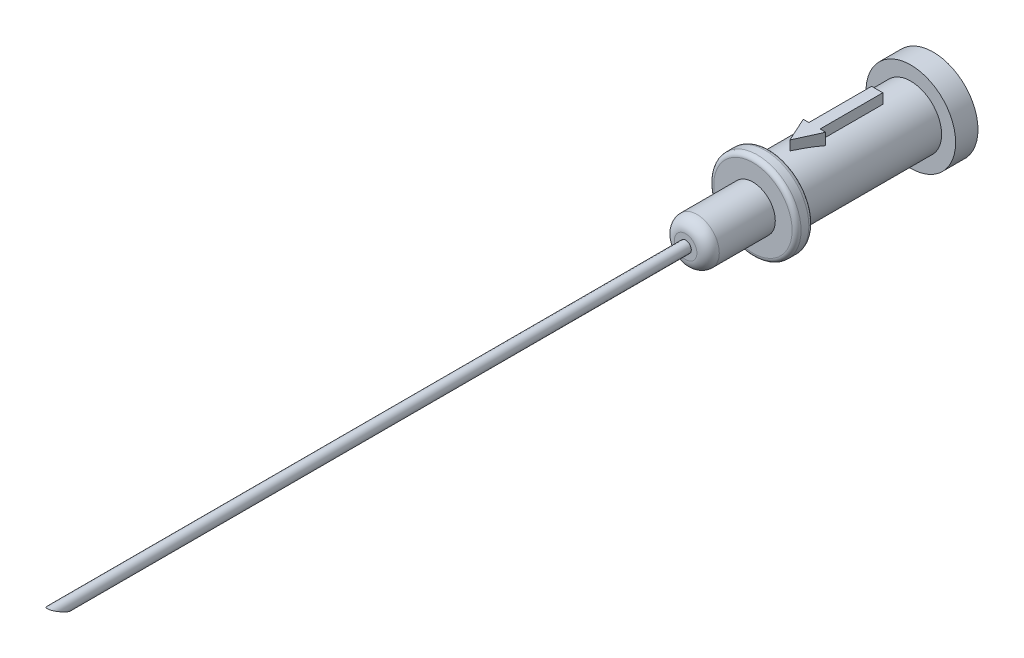
ISO-10303-21;
HEADER;
FILE_DESCRIPTION(('STEP AP214'),'2;1');
FILE_NAME('part.step','',(''),(''),'','','');
FILE_SCHEMA(('AUTOMOTIVE_DESIGN { 1 0 10303 214 1 1 1 1 }'));
ENDSEC;
DATA;
#1=APPLICATION_CONTEXT('core data for automotive mechanical design processes');
#2=APPLICATION_PROTOCOL_DEFINITION('international standard','automotive_design',2000,#1);
#3=PRODUCT_CONTEXT('',#1,'mechanical');
#4=PRODUCT('Part','Part','',(#3));
#5=PRODUCT_RELATED_PRODUCT_CATEGORY('part','',(#4));
#6=PRODUCT_DEFINITION_FORMATION('','',#4);
#7=PRODUCT_DEFINITION_CONTEXT('part definition',#1,'design');
#8=PRODUCT_DEFINITION('design','',#6,#7);
#9=PRODUCT_DEFINITION_SHAPE('','',#8);
#10=(LENGTH_UNIT() NAMED_UNIT(*) SI_UNIT(.MILLI.,.METRE.));
#11=(NAMED_UNIT(*) PLANE_ANGLE_UNIT() SI_UNIT($,.RADIAN.));
#12=(NAMED_UNIT(*) SI_UNIT($,.STERADIAN.) SOLID_ANGLE_UNIT());
#13=UNCERTAINTY_MEASURE_WITH_UNIT(LENGTH_MEASURE(1.E-05),#10,'distance_accuracy_value','');
#14=(GEOMETRIC_REPRESENTATION_CONTEXT(3) GLOBAL_UNCERTAINTY_ASSIGNED_CONTEXT((#13)) GLOBAL_UNIT_ASSIGNED_CONTEXT((#10,
#11,#12)) REPRESENTATION_CONTEXT('',''));
#15=CARTESIAN_POINT('',(0.,0.,0.));
#16=DIRECTION('',(0.,0.,1.));
#17=DIRECTION('',(1.,0.,0.));
#18=AXIS2_PLACEMENT_3D('',#15,#16,#17);
#19=CARTESIAN_POINT('',(0.,0.,14.6));
#20=DIRECTION('',(0.,0.,-1.));
#21=DIRECTION('',(-1.,0.,0.));
#22=AXIS2_PLACEMENT_3D('',#19,#20,#21);
#23=CYLINDRICAL_SURFACE('',#22,2.75);
#24=CARTESIAN_POINT('',(0.,0.,2.));
#25=DIRECTION('',(0.,0.,1.));
#26=DIRECTION('',(1.,0.,0.));
#27=AXIS2_PLACEMENT_3D('',#24,#25,#26);
#28=CIRCLE('',#27,2.75);
#29=CARTESIAN_POINT('',(2.75,0.,2.));
#30=VERTEX_POINT('',#29);
#31=EDGE_CURVE('E116',#30,#30,#28,.T.);
#32=ORIENTED_EDGE('',*,*,#31,.T.);
#33=EDGE_LOOP('',(#32));
#34=FACE_BOUND('',#33,.T.);
#35=CARTESIAN_POINT('',(0.,0.,14.6));
#36=DIRECTION('',(0.,0.,1.));
#37=DIRECTION('',(1.,0.,0.));
#38=AXIS2_PLACEMENT_3D('',#35,#36,#37);
#39=CIRCLE('',#38,2.75);
#40=CARTESIAN_POINT('',(2.75,0.,14.6));
#41=VERTEX_POINT('',#40);
#42=EDGE_CURVE('E122',#41,#41,#39,.T.);
#43=ORIENTED_EDGE('',*,*,#42,.F.);
#44=EDGE_LOOP('',(#43));
#45=FACE_BOUND('',#44,.T.);
#46=DIRECTION('',(0.,0.,-1.));
#47=VECTOR('',#46,1.);
#48=CARTESIAN_POINT('',(-0.499999999999998,2.70416345659799,14.6));
#49=LINE('',#48,#47);
#50=CARTESIAN_POINT('',(-0.499999999999999,2.70416345659799,5.));
#51=VERTEX_POINT('',#50);
#52=CARTESIAN_POINT('',(-0.499999999999999,2.70416345659799,10.6));
#53=VERTEX_POINT('',#52);
#54=EDGE_CURVE('E112',#51,#53,#49,.F.);
#55=ORIENTED_EDGE('',*,*,#54,.F.);
#56=CARTESIAN_POINT('',(0.,0.,5.));
#57=DIRECTION('',(0.,0.,1.));
#58=DIRECTION('',(1.,0.,0.));
#59=AXIS2_PLACEMENT_3D('',#56,#57,#58);
#60=CIRCLE('',#59,2.75);
#61=CARTESIAN_POINT('',(0.500000000000001,2.70416345659799,5.));
#62=VERTEX_POINT('',#61);
#63=EDGE_CURVE('E139',#62,#51,#60,.T.);
#64=ORIENTED_EDGE('',*,*,#63,.F.);
#65=DIRECTION('',(0.,0.,-1.));
#66=VECTOR('',#65,1.);
#67=CARTESIAN_POINT('',(0.500000000000002,2.70416345659799,14.6));
#68=LINE('',#67,#66);
#69=CARTESIAN_POINT('',(0.500000000000002,2.70416345659799,10.6));
#70=VERTEX_POINT('',#69);
#71=EDGE_CURVE('E142',#70,#62,#68,.T.);
#72=ORIENTED_EDGE('',*,*,#71,.F.);
#73=CARTESIAN_POINT('',(0.,0.,10.6));
#74=DIRECTION('',(0.,0.,1.));
#75=DIRECTION('',(1.,0.,0.));
#76=AXIS2_PLACEMENT_3D('',#73,#74,#75);
#77=CIRCLE('',#76,2.75);
#78=CARTESIAN_POINT('',(1.,2.5617376914899,10.6));
#79=VERTEX_POINT('',#78);
#80=EDGE_CURVE('E145',#79,#70,#77,.T.);
#81=ORIENTED_EDGE('',*,*,#80,.F.);
#82=CARTESIAN_POINT('',(0.,0.,12.8));
#83=DIRECTION('',(-0.910366477462605,0.,-0.413802944301184));
#84=DIRECTION('',(0.413802944301184,0.,-0.910366477462605));
#85=AXIS2_PLACEMENT_3D('',#82,#83,#84);
#86=ELLIPSE('',#85,6.64567528547702,2.75);
#87=CARTESIAN_POINT('',(0.,2.75,12.8));
#88=VERTEX_POINT('',#87);
#89=EDGE_CURVE('E148',#88,#79,#86,.T.);
#90=ORIENTED_EDGE('',*,*,#89,.F.);
#91=CARTESIAN_POINT('',(0.,0.,12.8));
#92=DIRECTION('',(0.910366477462605,0.,-0.413802944301184));
#93=DIRECTION('',(-0.413802944301184,0.,-0.910366477462605));
#94=AXIS2_PLACEMENT_3D('',#91,#92,#93);
#95=ELLIPSE('',#94,6.64567528547701,2.75);
#96=CARTESIAN_POINT('',(-0.999999999999999,2.5617376914899,10.6));
#97=VERTEX_POINT('',#96);
#98=EDGE_CURVE('E53',#97,#88,#95,.T.);
#99=ORIENTED_EDGE('',*,*,#98,.F.);
#100=CARTESIAN_POINT('',(0.,0.,10.6));
#101=DIRECTION('',(0.,0.,1.));
#102=DIRECTION('',(1.,0.,0.));
#103=AXIS2_PLACEMENT_3D('',#100,#101,#102);
#104=CIRCLE('',#103,2.75);
#105=EDGE_CURVE('E48',#53,#97,#104,.T.);
#106=ORIENTED_EDGE('',*,*,#105,.F.);
#107=EDGE_LOOP('',(#55,#64,#72,#81,#90,#99,#106));
#108=FACE_BOUND('',#107,.T.);
#109=ADVANCED_FACE('F33',(#34,#45,#108),#23,.T.);
#110=CARTESIAN_POINT('',(0.,0.,2.));
#111=DIRECTION('',(0.,0.,-1.));
#112=DIRECTION('',(-1.,0.,0.));
#113=AXIS2_PLACEMENT_3D('',#110,#111,#112);
#114=CYLINDRICAL_SURFACE('',#113,4.);
#115=CARTESIAN_POINT('',(0.,0.,2.));
#116=DIRECTION('',(0.,0.,1.));
#117=DIRECTION('',(1.,0.,0.));
#118=AXIS2_PLACEMENT_3D('',#115,#116,#117);
#119=CIRCLE('',#118,4.);
#120=CARTESIAN_POINT('',(4.,0.,2.));
#121=VERTEX_POINT('',#120);
#122=EDGE_CURVE('E128',#121,#121,#119,.T.);
#123=ORIENTED_EDGE('',*,*,#122,.F.);
#124=EDGE_LOOP('',(#123));
#125=FACE_BOUND('',#124,.T.);
#126=CARTESIAN_POINT('',(0.,0.,0.));
#127=DIRECTION('',(0.,0.,1.));
#128=DIRECTION('',(1.,0.,0.));
#129=AXIS2_PLACEMENT_3D('',#126,#127,#128);
#130=CIRCLE('',#129,4.);
#131=CARTESIAN_POINT('',(4.,0.,0.));
#132=VERTEX_POINT('',#131);
#133=EDGE_CURVE('E125',#132,#132,#130,.T.);
#134=ORIENTED_EDGE('',*,*,#133,.T.);
#135=EDGE_LOOP('',(#134));
#136=FACE_BOUND('',#135,.T.);
#137=ADVANCED_FACE('F194',(#125,#136),#114,.T.);
#138=CARTESIAN_POINT('',(0.,0.,2.));
#139=DIRECTION('',(0.,0.,1.));
#140=DIRECTION('',(1.,0.,0.));
#141=AXIS2_PLACEMENT_3D('',#138,#139,#140);
#142=PLANE('',#141);
#143=ORIENTED_EDGE('',*,*,#31,.F.);
#144=EDGE_LOOP('',(#143));
#145=FACE_BOUND('',#144,.T.);
#146=ORIENTED_EDGE('',*,*,#122,.T.);
#147=EDGE_LOOP('',(#146));
#148=FACE_BOUND('',#147,.T.);
#149=ADVANCED_FACE('F200',(#145,#148),#142,.T.);
#150=CARTESIAN_POINT('',(0.,0.,0.));
#151=DIRECTION('',(0.,0.,1.));
#152=DIRECTION('',(1.,0.,0.));
#153=AXIS2_PLACEMENT_3D('',#150,#151,#152);
#154=PLANE('',#153);
#155=ORIENTED_EDGE('',*,*,#133,.F.);
#156=EDGE_LOOP('',(#155));
#157=FACE_BOUND('',#156,.T.);
#158=ADVANCED_FACE('F208',(#157),#154,.F.);
#159=CARTESIAN_POINT('',(0.,0.,16.1));
#160=DIRECTION('',(0.,0.,-1.));
#161=DIRECTION('',(-1.,0.,0.));
#162=AXIS2_PLACEMENT_3D('',#159,#160,#161);
#163=CYLINDRICAL_SURFACE('',#162,3.9);
#164=CARTESIAN_POINT('',(0.,0.,15.7));
#165=DIRECTION('',(0.,0.,1.));
#166=DIRECTION('',(1.,0.,0.));
#167=AXIS2_PLACEMENT_3D('',#164,#165,#166);
#168=CIRCLE('',#167,3.9);
#169=CARTESIAN_POINT('',(3.9,0.,15.7));
#170=VERTEX_POINT('',#169);
#171=EDGE_CURVE('E41',#170,#170,#168,.F.);
#172=ORIENTED_EDGE('',*,*,#171,.T.);
#173=EDGE_LOOP('',(#172));
#174=FACE_BOUND('',#173,.T.);
#175=CARTESIAN_POINT('',(0.,0.,15.));
#176=DIRECTION('',(0.,0.,1.));
#177=DIRECTION('',(1.,0.,0.));
#178=AXIS2_PLACEMENT_3D('',#175,#176,#177);
#179=CIRCLE('',#178,3.9);
#180=CARTESIAN_POINT('',(3.9,0.,15.));
#181=VERTEX_POINT('',#180);
#182=EDGE_CURVE('E157',#181,#181,#179,.T.);
#183=ORIENTED_EDGE('',*,*,#182,.T.);
#184=EDGE_LOOP('',(#183));
#185=FACE_BOUND('',#184,.T.);
#186=ADVANCED_FACE('F162',(#174,#185),#163,.T.);
#187=CARTESIAN_POINT('',(0.,0.,16.1));
#188=DIRECTION('',(0.,0.,1.));
#189=DIRECTION('',(1.,0.,0.));
#190=AXIS2_PLACEMENT_3D('',#187,#188,#189);
#191=PLANE('',#190);
#192=CARTESIAN_POINT('',(0.,0.,16.1));
#193=DIRECTION('',(0.,0.,1.));
#194=DIRECTION('',(1.,0.,0.));
#195=AXIS2_PLACEMENT_3D('',#192,#193,#194);
#196=CIRCLE('',#195,3.5);
#197=CARTESIAN_POINT('',(3.5,0.,16.1));
#198=VERTEX_POINT('',#197);
#199=EDGE_CURVE('E154',#198,#198,#196,.T.);
#200=ORIENTED_EDGE('',*,*,#199,.T.);
#201=EDGE_LOOP('',(#200));
#202=FACE_BOUND('',#201,.T.);
#203=CARTESIAN_POINT('',(0.,0.,16.1));
#204=DIRECTION('',(0.,0.,1.));
#205=DIRECTION('',(1.,0.,0.));
#206=AXIS2_PLACEMENT_3D('',#203,#204,#205);
#207=CIRCLE('',#206,2.);
#208=CARTESIAN_POINT('',(2.,0.,16.1));
#209=VERTEX_POINT('',#208);
#210=EDGE_CURVE('E113',#209,#209,#207,.T.);
#211=ORIENTED_EDGE('',*,*,#210,.F.);
#212=EDGE_LOOP('',(#211));
#213=FACE_BOUND('',#212,.T.);
#214=ADVANCED_FACE('F171',(#202,#213),#191,.T.);
#215=CARTESIAN_POINT('',(0.,0.,14.6));
#216=DIRECTION('',(0.,0.,1.));
#217=DIRECTION('',(1.,0.,0.));
#218=AXIS2_PLACEMENT_3D('',#215,#216,#217);
#219=PLANE('',#218);
#220=CARTESIAN_POINT('',(0.,0.,14.6));
#221=DIRECTION('',(0.,0.,1.));
#222=DIRECTION('',(1.,0.,0.));
#223=AXIS2_PLACEMENT_3D('',#220,#221,#222);
#224=CIRCLE('',#223,3.5);
#225=CARTESIAN_POINT('',(3.5,0.,14.6));
#226=VERTEX_POINT('',#225);
#227=EDGE_CURVE('E11',#226,#226,#224,.F.);
#228=ORIENTED_EDGE('',*,*,#227,.T.);
#229=EDGE_LOOP('',(#228));
#230=FACE_BOUND('',#229,.T.);
#231=ORIENTED_EDGE('',*,*,#42,.T.);
#232=EDGE_LOOP('',(#231));
#233=FACE_BOUND('',#232,.T.);
#234=ADVANCED_FACE('F174',(#230,#233),#219,.F.);
#235=CARTESIAN_POINT('',(0.,0.,22.1));
#236=DIRECTION('',(0.,0.,-1.));
#237=DIRECTION('',(-1.,0.,0.));
#238=AXIS2_PLACEMENT_3D('',#235,#236,#237);
#239=CYLINDRICAL_SURFACE('',#238,2.);
#240=CARTESIAN_POINT('',(0.,0.,21.1));
#241=DIRECTION('',(0.,0.,1.));
#242=DIRECTION('',(1.,0.,0.));
#243=AXIS2_PLACEMENT_3D('',#240,#241,#242);
#244=CIRCLE('',#243,2.);
#245=CARTESIAN_POINT('',(2.,0.,21.1));
#246=VERTEX_POINT('',#245);
#247=EDGE_CURVE('E136',#246,#246,#244,.F.);
#248=ORIENTED_EDGE('',*,*,#247,.T.);
#249=EDGE_LOOP('',(#248));
#250=FACE_BOUND('',#249,.T.);
#251=ORIENTED_EDGE('',*,*,#210,.T.);
#252=EDGE_LOOP('',(#251));
#253=FACE_BOUND('',#252,.T.);
#254=ADVANCED_FACE('F178',(#250,#253),#239,.T.);
#255=CARTESIAN_POINT('',(0.,0.,22.1));
#256=DIRECTION('',(0.,0.,1.));
#257=DIRECTION('',(1.,0.,0.));
#258=AXIS2_PLACEMENT_3D('',#255,#256,#257);
#259=PLANE('',#258);
#260=CARTESIAN_POINT('',(0.,0.,22.1));
#261=DIRECTION('',(0.,0.,1.));
#262=DIRECTION('',(1.,0.,0.));
#263=AXIS2_PLACEMENT_3D('',#260,#261,#262);
#264=CIRCLE('',#263,0.5);
#265=CARTESIAN_POINT('',(0.5,0.,22.1));
#266=VERTEX_POINT('',#265);
#267=EDGE_CURVE('E109',#266,#266,#264,.T.);
#268=ORIENTED_EDGE('',*,*,#267,.F.);
#269=EDGE_LOOP('',(#268));
#270=FACE_BOUND('',#269,.T.);
#271=CARTESIAN_POINT('',(0.,0.,22.1));
#272=DIRECTION('',(0.,0.,1.));
#273=DIRECTION('',(1.,0.,0.));
#274=AXIS2_PLACEMENT_3D('',#271,#272,#273);
#275=CIRCLE('',#274,1.);
#276=CARTESIAN_POINT('',(1.,0.,22.1));
#277=VERTEX_POINT('',#276);
#278=EDGE_CURVE('E131',#277,#277,#275,.T.);
#279=ORIENTED_EDGE('',*,*,#278,.T.);
#280=EDGE_LOOP('',(#279));
#281=FACE_BOUND('',#280,.T.);
#282=ADVANCED_FACE('F180',(#270,#281),#259,.T.);
#283=CARTESIAN_POINT('',(0.,0.,21.1));
#284=DIRECTION('',(0.,0.,1.));
#285=DIRECTION('',(1.,0.,0.));
#286=AXIS2_PLACEMENT_3D('',#283,#284,#285);
#287=DEGENERATE_TOROIDAL_SURFACE('',#286,1.,1.,.T.);
#288=ORIENTED_EDGE('',*,*,#247,.F.);
#289=EDGE_LOOP('',(#288));
#290=FACE_BOUND('',#289,.T.);
#291=ORIENTED_EDGE('',*,*,#278,.F.);
#292=EDGE_LOOP('',(#291));
#293=FACE_BOUND('',#292,.T.);
#294=ADVANCED_FACE('F187',(#290,#293),#287,.T.);
#295=CARTESIAN_POINT('',(-0.499999999999999,3.6,5.));
#296=DIRECTION('',(1.,0.,0.));
#297=DIRECTION('',(0.,0.,-1.));
#298=AXIS2_PLACEMENT_3D('',#295,#296,#297);
#299=PLANE('',#298);
#300=DIRECTION('',(0.,-1.,0.));
#301=VECTOR('',#300,1.);
#302=CARTESIAN_POINT('',(-0.499999999999999,3.6,5.));
#303=LINE('',#302,#301);
#304=CARTESIAN_POINT('',(-0.499999999999999,3.6,5.));
#305=VERTEX_POINT('',#304);
#306=EDGE_CURVE('E273',#305,#51,#303,.T.);
#307=ORIENTED_EDGE('',*,*,#306,.T.);
#308=ORIENTED_EDGE('',*,*,#54,.T.);
#309=DIRECTION('',(0.,-1.,0.));
#310=VECTOR('',#309,1.);
#311=CARTESIAN_POINT('',(-0.499999999999999,3.6,10.6));
#312=LINE('',#311,#310);
#313=CARTESIAN_POINT('',(-0.499999999999999,3.6,10.6));
#314=VERTEX_POINT('',#313);
#315=EDGE_CURVE('E94',#314,#53,#312,.T.);
#316=ORIENTED_EDGE('',*,*,#315,.F.);
#317=DIRECTION('',(0.,0.,1.));
#318=VECTOR('',#317,1.);
#319=CARTESIAN_POINT('',(-0.499999999999999,3.6,5.));
#320=LINE('',#319,#318);
#321=EDGE_CURVE('E100',#305,#314,#320,.T.);
#322=ORIENTED_EDGE('',*,*,#321,.F.);
#323=EDGE_LOOP('',(#307,#308,#316,#322));
#324=FACE_BOUND('',#323,.T.);
#325=ADVANCED_FACE('F111',(#324),#299,.F.);
#326=CARTESIAN_POINT('',(0.500000000000001,3.6,5.));
#327=DIRECTION('',(-1.,0.,0.));
#328=DIRECTION('',(0.,0.,1.));
#329=AXIS2_PLACEMENT_3D('',#326,#327,#328);
#330=PLANE('',#329);
#331=DIRECTION('',(0.,-1.,0.));
#332=VECTOR('',#331,1.);
#333=CARTESIAN_POINT('',(0.500000000000001,3.6,10.6));
#334=LINE('',#333,#332);
#335=CARTESIAN_POINT('',(0.500000000000001,3.6,10.6));
#336=VERTEX_POINT('',#335);
#337=EDGE_CURVE('E278',#336,#70,#334,.T.);
#338=ORIENTED_EDGE('',*,*,#337,.T.);
#339=ORIENTED_EDGE('',*,*,#71,.T.);
#340=DIRECTION('',(0.,-1.,0.));
#341=VECTOR('',#340,1.);
#342=CARTESIAN_POINT('',(0.500000000000001,3.6,5.));
#343=LINE('',#342,#341);
#344=CARTESIAN_POINT('',(0.500000000000001,3.6,5.));
#345=VERTEX_POINT('',#344);
#346=EDGE_CURVE('E275',#345,#62,#343,.T.);
#347=ORIENTED_EDGE('',*,*,#346,.F.);
#348=DIRECTION('',(0.,0.,-1.));
#349=VECTOR('',#348,1.);
#350=CARTESIAN_POINT('',(0.500000000000001,3.6,5.));
#351=LINE('',#350,#349);
#352=EDGE_CURVE('E270',#336,#345,#351,.T.);
#353=ORIENTED_EDGE('',*,*,#352,.F.);
#354=EDGE_LOOP('',(#338,#339,#347,#353));
#355=FACE_BOUND('',#354,.T.);
#356=ADVANCED_FACE('F218',(#355),#330,.F.);
#357=CARTESIAN_POINT('',(-0.999999999999999,3.6,10.6));
#358=DIRECTION('',(0.,0.,1.));
#359=DIRECTION('',(1.,0.,0.));
#360=AXIS2_PLACEMENT_3D('',#357,#358,#359);
#361=PLANE('',#360);
#362=ORIENTED_EDGE('',*,*,#315,.T.);
#363=ORIENTED_EDGE('',*,*,#105,.T.);
#364=DIRECTION('',(0.,-1.,0.));
#365=VECTOR('',#364,1.);
#366=CARTESIAN_POINT('',(-0.999999999999999,3.6,10.6));
#367=LINE('',#366,#365);
#368=CARTESIAN_POINT('',(-0.999999999999999,3.6,10.6));
#369=VERTEX_POINT('',#368);
#370=EDGE_CURVE('E96',#369,#97,#367,.T.);
#371=ORIENTED_EDGE('',*,*,#370,.F.);
#372=DIRECTION('',(-1.,0.,0.));
#373=VECTOR('',#372,1.);
#374=CARTESIAN_POINT('',(-0.999999999999999,3.6,10.6));
#375=LINE('',#374,#373);
#376=EDGE_CURVE('E90',#314,#369,#375,.T.);
#377=ORIENTED_EDGE('',*,*,#376,.F.);
#378=EDGE_LOOP('',(#362,#363,#371,#377));
#379=FACE_BOUND('',#378,.T.);
#380=ADVANCED_FACE('F92',(#379),#361,.F.);
#381=CARTESIAN_POINT('',(0.,3.6,12.8));
#382=DIRECTION('',(0.910366477462605,0.,-0.413802944301184));
#383=DIRECTION('',(-0.413802944301184,0.,-0.910366477462605));
#384=AXIS2_PLACEMENT_3D('',#381,#382,#383);
#385=PLANE('',#384);
#386=ORIENTED_EDGE('',*,*,#370,.T.);
#387=ORIENTED_EDGE('',*,*,#98,.T.);
#388=DIRECTION('',(0.,-1.,0.));
#389=VECTOR('',#388,1.);
#390=CARTESIAN_POINT('',(0.,3.6,12.8));
#391=LINE('',#390,#389);
#392=CARTESIAN_POINT('',(0.,3.6,12.8));
#393=VERTEX_POINT('',#392);
#394=EDGE_CURVE('E118',#393,#88,#391,.T.);
#395=ORIENTED_EDGE('',*,*,#394,.F.);
#396=DIRECTION('',(0.413802944301184,0.,0.910366477462605));
#397=VECTOR('',#396,1.);
#398=CARTESIAN_POINT('',(0.,3.6,12.8));
#399=LINE('',#398,#397);
#400=EDGE_CURVE('E99',#369,#393,#399,.T.);
#401=ORIENTED_EDGE('',*,*,#400,.F.);
#402=EDGE_LOOP('',(#386,#387,#395,#401));
#403=FACE_BOUND('',#402,.T.);
#404=ADVANCED_FACE('F232',(#403),#385,.F.);
#405=CARTESIAN_POINT('',(1.,3.6,10.6));
#406=DIRECTION('',(-0.910366477462605,0.,-0.413802944301184));
#407=DIRECTION('',(-0.413802944301184,0.,0.910366477462605));
#408=AXIS2_PLACEMENT_3D('',#405,#406,#407);
#409=PLANE('',#408);
#410=ORIENTED_EDGE('',*,*,#394,.T.);
#411=ORIENTED_EDGE('',*,*,#89,.T.);
#412=DIRECTION('',(0.,-1.,0.));
#413=VECTOR('',#412,1.);
#414=CARTESIAN_POINT('',(1.,3.6,10.6));
#415=LINE('',#414,#413);
#416=CARTESIAN_POINT('',(1.,3.6,10.6));
#417=VERTEX_POINT('',#416);
#418=EDGE_CURVE('E281',#417,#79,#415,.T.);
#419=ORIENTED_EDGE('',*,*,#418,.F.);
#420=DIRECTION('',(0.413802944301184,0.,-0.910366477462605));
#421=VECTOR('',#420,1.);
#422=CARTESIAN_POINT('',(1.,3.6,10.6));
#423=LINE('',#422,#421);
#424=EDGE_CURVE('E266',#393,#417,#423,.T.);
#425=ORIENTED_EDGE('',*,*,#424,.F.);
#426=EDGE_LOOP('',(#410,#411,#419,#425));
#427=FACE_BOUND('',#426,.T.);
#428=ADVANCED_FACE('F235',(#427),#409,.F.);
#429=CARTESIAN_POINT('',(0.500000000000001,3.6,10.6));
#430=DIRECTION('',(0.,0.,1.));
#431=DIRECTION('',(1.,0.,0.));
#432=AXIS2_PLACEMENT_3D('',#429,#430,#431);
#433=PLANE('',#432);
#434=ORIENTED_EDGE('',*,*,#418,.T.);
#435=ORIENTED_EDGE('',*,*,#80,.T.);
#436=ORIENTED_EDGE('',*,*,#337,.F.);
#437=DIRECTION('',(-1.,0.,0.));
#438=VECTOR('',#437,1.);
#439=CARTESIAN_POINT('',(0.500000000000001,3.6,10.6));
#440=LINE('',#439,#438);
#441=EDGE_CURVE('E268',#417,#336,#440,.T.);
#442=ORIENTED_EDGE('',*,*,#441,.F.);
#443=EDGE_LOOP('',(#434,#435,#436,#442));
#444=FACE_BOUND('',#443,.T.);
#445=ADVANCED_FACE('F239',(#444),#433,.F.);
#446=CARTESIAN_POINT('',(-0.499999999999999,3.6,5.));
#447=DIRECTION('',(0.,0.,1.));
#448=DIRECTION('',(1.,0.,0.));
#449=AXIS2_PLACEMENT_3D('',#446,#447,#448);
#450=PLANE('',#449);
#451=ORIENTED_EDGE('',*,*,#346,.T.);
#452=ORIENTED_EDGE('',*,*,#63,.T.);
#453=ORIENTED_EDGE('',*,*,#306,.F.);
#454=DIRECTION('',(-1.,0.,0.));
#455=VECTOR('',#454,1.);
#456=CARTESIAN_POINT('',(-0.499999999999999,3.6,5.));
#457=LINE('',#456,#455);
#458=EDGE_CURVE('E105',#345,#305,#457,.T.);
#459=ORIENTED_EDGE('',*,*,#458,.F.);
#460=EDGE_LOOP('',(#451,#452,#453,#459));
#461=FACE_BOUND('',#460,.T.);
#462=ADVANCED_FACE('F242',(#461),#450,.F.);
#463=CARTESIAN_POINT('',(0.,3.6,0.));
#464=DIRECTION('',(0.,1.,0.));
#465=DIRECTION('',(0.,0.,1.));
#466=AXIS2_PLACEMENT_3D('',#463,#464,#465);
#467=PLANE('',#466);
#468=ORIENTED_EDGE('',*,*,#321,.T.);
#469=ORIENTED_EDGE('',*,*,#376,.T.);
#470=ORIENTED_EDGE('',*,*,#400,.T.);
#471=ORIENTED_EDGE('',*,*,#424,.T.);
#472=ORIENTED_EDGE('',*,*,#441,.T.);
#473=ORIENTED_EDGE('',*,*,#352,.T.);
#474=ORIENTED_EDGE('',*,*,#458,.T.);
#475=EDGE_LOOP('',(#468,#469,#470,#471,#472,#473,#474));
#476=FACE_BOUND('',#475,.T.);
#477=ADVANCED_FACE('F103',(#476),#467,.T.);
#478=CARTESIAN_POINT('',(0.,0.,79.1));
#479=DIRECTION('',(0.,0.,-1.));
#480=DIRECTION('',(-1.,0.,0.));
#481=AXIS2_PLACEMENT_3D('',#478,#479,#480);
#482=CYLINDRICAL_SURFACE('',#481,0.5);
#483=CARTESIAN_POINT('',(0.,0.,78.1));
#484=DIRECTION('',(0.,0.894427190999916,-0.447213595499958));
#485=DIRECTION('',(0.,-0.447213595499958,-0.894427190999916));
#486=AXIS2_PLACEMENT_3D('',#483,#484,#485);
#487=ELLIPSE('',#486,1.1180339887499,0.5);
#488=CARTESIAN_POINT('',(0.,-0.5,77.1));
#489=VERTEX_POINT('',#488);
#490=EDGE_CURVE('E260',#489,#489,#487,.T.);
#491=ORIENTED_EDGE('',*,*,#490,.T.);
#492=EDGE_LOOP('',(#491));
#493=FACE_BOUND('',#492,.T.);
#494=ORIENTED_EDGE('',*,*,#267,.T.);
#495=EDGE_LOOP('',(#494));
#496=FACE_BOUND('',#495,.T.);
#497=ADVANCED_FACE('F250',(#493,#496),#482,.T.);
#498=CARTESIAN_POINT('',(-4.,0.5,79.1));
#499=DIRECTION('',(0.,0.894427190999916,-0.447213595499958));
#500=DIRECTION('',(0.,0.447213595499958,0.894427190999916));
#501=AXIS2_PLACEMENT_3D('',#498,#499,#500);
#502=PLANE('',#501);
#503=ORIENTED_EDGE('',*,*,#490,.F.);
#504=EDGE_LOOP('',(#503));
#505=FACE_BOUND('',#504,.T.);
#506=ADVANCED_FACE('F168',(#505),#502,.F.);
#507=CARTESIAN_POINT('',(0.,0.,15.7));
#508=DIRECTION('',(0.,0.,1.));
#509=DIRECTION('',(1.,0.,0.));
#510=AXIS2_PLACEMENT_3D('',#507,#508,#509);
#511=TOROIDAL_SURFACE('',#510,3.5,0.4);
#512=ORIENTED_EDGE('',*,*,#171,.F.);
#513=EDGE_LOOP('',(#512));
#514=FACE_BOUND('',#513,.T.);
#515=ORIENTED_EDGE('',*,*,#199,.F.);
#516=EDGE_LOOP('',(#515));
#517=FACE_BOUND('',#516,.T.);
#518=ADVANCED_FACE('F165',(#514,#517),#511,.T.);
#519=CARTESIAN_POINT('',(0.,0.,15.));
#520=DIRECTION('',(0.,0.,1.));
#521=DIRECTION('',(1.,0.,0.));
#522=AXIS2_PLACEMENT_3D('',#519,#520,#521);
#523=TOROIDAL_SURFACE('',#522,3.5,0.4);
#524=ORIENTED_EDGE('',*,*,#227,.F.);
#525=EDGE_LOOP('',(#524));
#526=FACE_BOUND('',#525,.T.);
#527=ORIENTED_EDGE('',*,*,#182,.F.);
#528=EDGE_LOOP('',(#527));
#529=FACE_BOUND('',#528,.T.);
#530=ADVANCED_FACE('F35',(#526,#529),#523,.T.);
#531=CLOSED_SHELL('',(#109,#137,#149,#158,#186,#214,#234,#254,#282,#294,#325,#356,#380,#404,
#428,#445,#462,#477,#497,#506,#518,#530));
#532=MANIFOLD_SOLID_BREP('B2',#531);
#533=ADVANCED_BREP_SHAPE_REPRESENTATION('',(#18,#532),#14);
#534=SHAPE_DEFINITION_REPRESENTATION(#9,#533);
ENDSEC;
END-ISO-10303-21;
